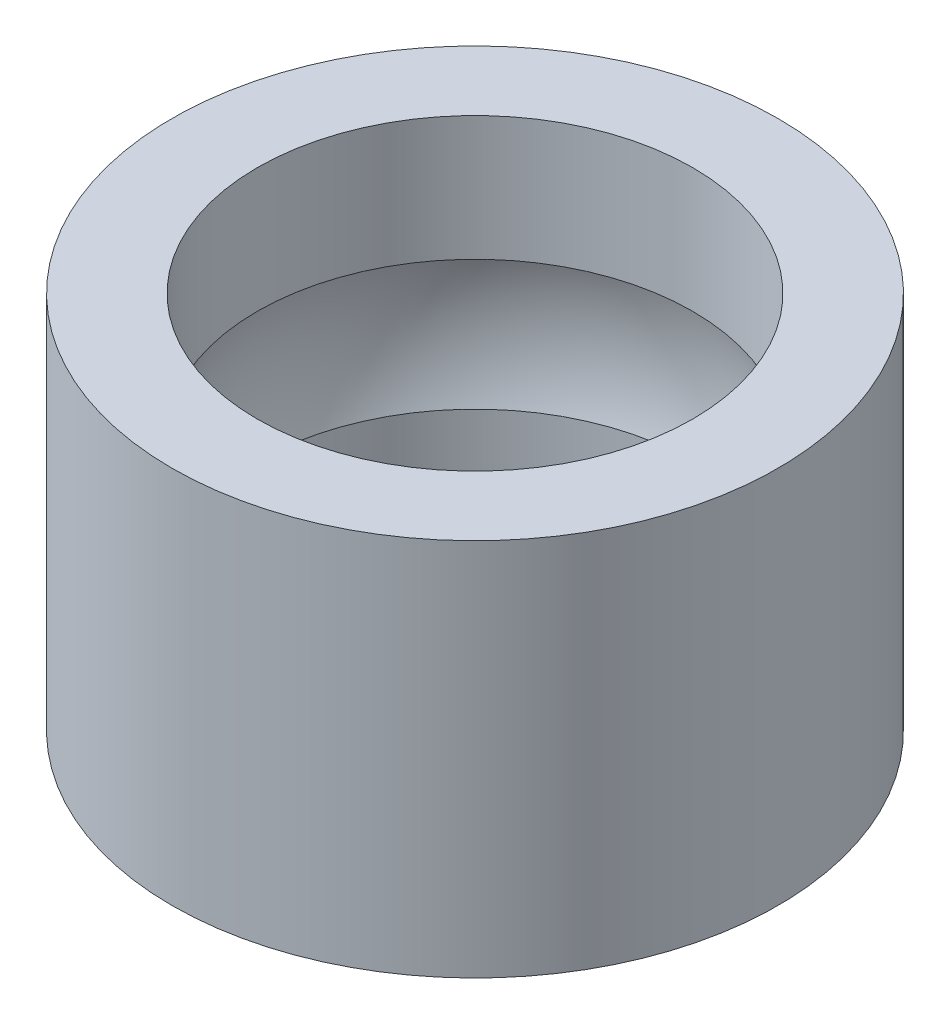
ISO-10303-21;
HEADER;
FILE_DESCRIPTION(('STEP AP214'),'2;1');
FILE_NAME('part.step','',(''),(''),'','','');
FILE_SCHEMA(('AUTOMOTIVE_DESIGN { 1 0 10303 214 1 1 1 1 }'));
ENDSEC;
DATA;
#1=APPLICATION_CONTEXT('core data for automotive mechanical design processes');
#2=APPLICATION_PROTOCOL_DEFINITION('international standard','automotive_design',2000,#1);
#3=PRODUCT_CONTEXT('',#1,'mechanical');
#4=PRODUCT('Part','Part','',(#3));
#5=PRODUCT_RELATED_PRODUCT_CATEGORY('part','',(#4));
#6=PRODUCT_DEFINITION_FORMATION('','',#4);
#7=PRODUCT_DEFINITION_CONTEXT('part definition',#1,'design');
#8=PRODUCT_DEFINITION('design','',#6,#7);
#9=PRODUCT_DEFINITION_SHAPE('','',#8);
#10=(LENGTH_UNIT() NAMED_UNIT(*) SI_UNIT(.MILLI.,.METRE.));
#11=(NAMED_UNIT(*) PLANE_ANGLE_UNIT() SI_UNIT($,.RADIAN.));
#12=(NAMED_UNIT(*) SI_UNIT($,.STERADIAN.) SOLID_ANGLE_UNIT());
#13=UNCERTAINTY_MEASURE_WITH_UNIT(LENGTH_MEASURE(1.E-05),#10,'distance_accuracy_value','');
#14=(GEOMETRIC_REPRESENTATION_CONTEXT(3) GLOBAL_UNCERTAINTY_ASSIGNED_CONTEXT((#13)) GLOBAL_UNIT_ASSIGNED_CONTEXT((#10,
#11,#12)) REPRESENTATION_CONTEXT('',''));
#15=CARTESIAN_POINT('',(0.,0.,0.));
#16=DIRECTION('',(0.,0.,1.));
#17=DIRECTION('',(1.,0.,0.));
#18=AXIS2_PLACEMENT_3D('',#15,#16,#17);
#19=CARTESIAN_POINT('',(0.,5.,0.));
#20=DIRECTION('',(0.,-1.,0.));
#21=DIRECTION('',(0.,0.,-1.));
#22=AXIS2_PLACEMENT_3D('',#19,#20,#21);
#23=CYLINDRICAL_SURFACE('',#22,4.);
#24=CARTESIAN_POINT('',(0.,5.,0.));
#25=DIRECTION('',(0.,1.,0.));
#26=DIRECTION('',(0.,0.,1.));
#27=AXIS2_PLACEMENT_3D('',#24,#25,#26);
#28=CIRCLE('',#27,4.);
#29=CARTESIAN_POINT('',(0.,5.,4.));
#30=VERTEX_POINT('',#29);
#31=EDGE_CURVE('E10',#30,#30,#28,.T.);
#32=ORIENTED_EDGE('',*,*,#31,.F.);
#33=EDGE_LOOP('',(#32));
#34=FACE_BOUND('',#33,.T.);
#35=CARTESIAN_POINT('',(0.,0.,0.));
#36=DIRECTION('',(0.,1.,0.));
#37=DIRECTION('',(0.,0.,1.));
#38=AXIS2_PLACEMENT_3D('',#35,#36,#37);
#39=CIRCLE('',#38,4.);
#40=CARTESIAN_POINT('',(0.,0.,4.));
#41=VERTEX_POINT('',#40);
#42=EDGE_CURVE('E48',#41,#41,#39,.T.);
#43=ORIENTED_EDGE('',*,*,#42,.T.);
#44=EDGE_LOOP('',(#43));
#45=FACE_BOUND('',#44,.T.);
#46=ADVANCED_FACE('F45',(#34,#45),#23,.T.);
#47=CARTESIAN_POINT('',(0.,5.,0.));
#48=DIRECTION('',(0.,1.,0.));
#49=DIRECTION('',(0.,0.,1.));
#50=AXIS2_PLACEMENT_3D('',#47,#48,#49);
#51=PLANE('',#50);
#52=CARTESIAN_POINT('',(0.,5.,0.));
#53=DIRECTION('',(0.,1.,0.));
#54=DIRECTION('',(0.,0.,1.));
#55=AXIS2_PLACEMENT_3D('',#52,#53,#54);
#56=CIRCLE('',#55,2.875);
#57=CARTESIAN_POINT('',(0.,5.,2.875));
#58=VERTEX_POINT('',#57);
#59=EDGE_CURVE('E70',#58,#58,#56,.T.);
#60=ORIENTED_EDGE('',*,*,#59,.F.);
#61=EDGE_LOOP('',(#60));
#62=FACE_BOUND('',#61,.T.);
#63=ORIENTED_EDGE('',*,*,#31,.T.);
#64=EDGE_LOOP('',(#63));
#65=FACE_BOUND('',#64,.T.);
#66=ADVANCED_FACE('F77',(#62,#65),#51,.T.);
#67=CARTESIAN_POINT('',(0.,0.,0.));
#68=DIRECTION('',(0.,1.,0.));
#69=DIRECTION('',(0.,0.,1.));
#70=AXIS2_PLACEMENT_3D('',#67,#68,#69);
#71=PLANE('',#70);
#72=CARTESIAN_POINT('',(0.,0.,0.));
#73=DIRECTION('',(0.,1.,0.));
#74=DIRECTION('',(0.,0.,1.));
#75=AXIS2_PLACEMENT_3D('',#72,#73,#74);
#76=CIRCLE('',#75,2.875);
#77=CARTESIAN_POINT('',(0.,0.,2.875));
#78=VERTEX_POINT('',#77);
#79=EDGE_CURVE('E66',#78,#78,#76,.T.);
#80=ORIENTED_EDGE('',*,*,#79,.T.);
#81=EDGE_LOOP('',(#80));
#82=FACE_BOUND('',#81,.T.);
#83=ORIENTED_EDGE('',*,*,#42,.F.);
#84=EDGE_LOOP('',(#83));
#85=FACE_BOUND('',#84,.T.);
#86=ADVANCED_FACE('F79',(#82,#85),#71,.F.);
#87=CARTESIAN_POINT('',(0.,5.765782143469,0.));
#88=DIRECTION('',(0.,1.,0.));
#89=DIRECTION('',(0.,0.,1.));
#90=AXIS2_PLACEMENT_3D('',#87,#88,#89);
#91=CYLINDRICAL_SURFACE('',#90,2.875);
#92=CARTESIAN_POINT('',(0.,3.35695682505013,0.));
#93=DIRECTION('',(0.,1.,0.));
#94=DIRECTION('',(0.,0.,1.));
#95=AXIS2_PLACEMENT_3D('',#92,#93,#94);
#96=CIRCLE('',#95,2.875);
#97=CARTESIAN_POINT('',(0.,3.35695682505013,2.875));
#98=VERTEX_POINT('',#97);
#99=EDGE_CURVE('E57',#98,#98,#96,.T.);
#100=ORIENTED_EDGE('',*,*,#99,.F.);
#101=EDGE_LOOP('',(#100));
#102=FACE_BOUND('',#101,.T.);
#103=ORIENTED_EDGE('',*,*,#59,.T.);
#104=EDGE_LOOP('',(#103));
#105=FACE_BOUND('',#104,.T.);
#106=ADVANCED_FACE('F75',(#102,#105),#91,.F.);
#107=CARTESIAN_POINT('',(0.,2.5,0.));
#108=DIRECTION('',(0.,1.,0.));
#109=DIRECTION('',(0.,0.,1.));
#110=AXIS2_PLACEMENT_3D('',#107,#108,#109);
#111=SPHERICAL_SURFACE('',#110,3.);
#112=CARTESIAN_POINT('',(0.,1.64304317494987,0.));
#113=DIRECTION('',(0.,1.,0.));
#114=DIRECTION('',(0.,0.,1.));
#115=AXIS2_PLACEMENT_3D('',#112,#113,#114);
#116=CIRCLE('',#115,2.875);
#117=CARTESIAN_POINT('',(0.,1.64304317494987,2.875));
#118=VERTEX_POINT('',#117);
#119=EDGE_CURVE('E62',#118,#118,#116,.T.);
#120=CARTESIAN_POINT('',(0.,1.64304317494987,2.875));
#121=CARTESIAN_POINT('',(0.,1.66039421367485,2.88017187788945));
#122=CARTESIAN_POINT('',(0.,1.67779208203055,2.88518664517596));
#123=CARTESIAN_POINT('',(0.,1.71267575228563,2.89490039635111));
#124=CARTESIAN_POINT('',(0.,1.730161554185,2.89959938023977));
#125=CARTESIAN_POINT('',(0.,1.76521536580959,2.90868000242728));
#126=CARTESIAN_POINT('',(0.,1.78278337553482,2.91306164072614));
#127=CARTESIAN_POINT('',(0.,1.81799584242229,2.92150614130359));
#128=CARTESIAN_POINT('',(0.,1.83564029958454,2.92556900358219));
#129=CARTESIAN_POINT('',(0.,1.87099987796741,2.93337461875086));
#130=CARTESIAN_POINT('',(0.,1.88871499918803,2.93711737164093));
#131=CARTESIAN_POINT('',(0.,1.92421009859094,2.94428154158685));
#132=CARTESIAN_POINT('',(0.,1.94199007677324,2.94770295864269));
#133=CARTESIAN_POINT('',(0.,1.97760906189142,2.95422333527406));
#134=CARTESIAN_POINT('',(0.,1.99544806882731,2.95732229484958));
#135=CARTESIAN_POINT('',(0.,2.03117926385526,2.9631967407181));
#136=CARTESIAN_POINT('',(0.,2.04907145194733,2.96597222701109));
#137=CARTESIAN_POINT('',(0.,2.08490314426824,2.97119881650787));
#138=CARTESIAN_POINT('',(0.,2.10284264849708,2.97364991971165));
#139=CARTESIAN_POINT('',(0.,2.13876309255915,2.97822693956569));
#140=CARTESIAN_POINT('',(0.,2.15674403239237,2.98035285621596));
#141=CARTESIAN_POINT('',(0.,2.19274145354907,2.98427880609138));
#142=CARTESIAN_POINT('',(0.,2.21075793487254,2.98607883931653));
#143=CARTESIAN_POINT('',(0.,2.24682053324496,2.98935243229477));
#144=CARTESIAN_POINT('',(0.,2.26486665029391,2.99082599204786));
#145=CARTESIAN_POINT('',(0.,2.30098260463806,2.99344615505214));
#146=CARTESIAN_POINT('',(0.,2.31905244193325,2.99459275830333));
#147=CARTESIAN_POINT('',(0.,2.35520991351519,2.9965586324497));
#148=CARTESIAN_POINT('',(0.,2.37329754780193,2.99737790334487));
#149=CARTESIAN_POINT('',(0.,2.40948468427843,2.99868884422391));
#150=CARTESIAN_POINT('',(0.,2.4275841864682,2.99918051420777));
#151=CARTESIAN_POINT('',(0.,2.46378912577198,2.99983609209582));
#152=CARTESIAN_POINT('',(0.,2.48189456288599,3.));
#153=CARTESIAN_POINT('',(0.,2.51810543711401,3.));
#154=CARTESIAN_POINT('',(0.,2.53621087422802,2.99983609209582));
#155=CARTESIAN_POINT('',(0.,2.5724158135318,2.99918051420778));
#156=CARTESIAN_POINT('',(0.,2.59051531572157,2.99868884422391));
#157=CARTESIAN_POINT('',(0.,2.62670245219807,2.99737790334487));
#158=CARTESIAN_POINT('',(0.,2.64479008648481,2.9965586324497));
#159=CARTESIAN_POINT('',(0.,2.68094755806674,2.99459275830333));
#160=CARTESIAN_POINT('',(0.,2.69901739536194,2.99344615505214));
#161=CARTESIAN_POINT('',(0.,2.73513334970609,2.99082599204786));
#162=CARTESIAN_POINT('',(0.,2.75317946675504,2.98935243229477));
#163=CARTESIAN_POINT('',(0.,2.78924206512746,2.98607883931653));
#164=CARTESIAN_POINT('',(0.,2.80725854645093,2.98427880609138));
#165=CARTESIAN_POINT('',(0.,2.84325596760763,2.98035285621596));
#166=CARTESIAN_POINT('',(0.,2.86123690744085,2.97822693956569));
#167=CARTESIAN_POINT('',(0.,2.89715735150292,2.97364991971165));
#168=CARTESIAN_POINT('',(0.,2.91509685573176,2.97119881650787));
#169=CARTESIAN_POINT('',(0.,2.95092854805267,2.96597222701109));
#170=CARTESIAN_POINT('',(0.,2.96882073614474,2.9631967407181));
#171=CARTESIAN_POINT('',(0.,3.00455193117269,2.95732229484958));
#172=CARTESIAN_POINT('',(0.,3.02239093810858,2.95422333527406));
#173=CARTESIAN_POINT('',(0.,3.05800992322676,2.94770295864269));
#174=CARTESIAN_POINT('',(0.,3.07578990140905,2.94428154158685));
#175=CARTESIAN_POINT('',(0.,3.11128500081197,2.93711737164093));
#176=CARTESIAN_POINT('',(0.,3.12900012203259,2.93337461875086));
#177=CARTESIAN_POINT('',(0.,3.16435970041546,2.92556900358219));
#178=CARTESIAN_POINT('',(0.,3.18200415757771,2.92150614130359));
#179=CARTESIAN_POINT('',(0.,3.21721662446518,2.91306164072614));
#180=CARTESIAN_POINT('',(0.,3.2347846341904,2.90868000242728));
#181=CARTESIAN_POINT('',(0.,3.269838445815,2.89959938023977));
#182=CARTESIAN_POINT('',(0.,3.28732424771437,2.89490039635111));
#183=CARTESIAN_POINT('',(0.,3.32220791796944,2.88518664517596));
#184=CARTESIAN_POINT('',(0.,3.33960578632515,2.88017187788946));
#185=CARTESIAN_POINT('',(0.,3.35695682505013,2.875));
#186=B_SPLINE_CURVE_WITH_KNOTS('',3,(#120,#121,#122,#123,#124,#125,#126,#127,#128,#129,#130,
#131,#132,#133,#134,#135,#136,#137,#138,#139,#140,#141,#142,#143,#144,#145,#146,#147,#148,#149,
#150,#151,#152,#153,#154,#155,#156,#157,#158,#159,#160,#161,#162,#163,#164,#165,#166,#167,#168,
#169,#170,#171,#172,#173,#174,#175,#176,#177,#178,#179,#180,#181,#182,#183,#184,#185),
.UNSPECIFIED.,.F.,.F.,(4,2,2,2,2,2,2,2,2,2,2,2,2,2,2,2,2,2,2,2,2,2,2,2,2,2,2,2,2,2,2,2,4),(0.,
0.0543155694917026,0.108631138983406,0.162946708475108,0.217262277966812,0.271577847458514,
0.325893416950217,0.38020898644192,0.434524555933623,0.488840125425326,0.543155694917029,
0.597471264408731,0.651786833900434,0.706102403392137,0.76041797288384,0.814733542375543,
0.869049111867246,0.923364681358949,0.977680250850652,1.03199582034235,1.08631138983406,
1.14062695932576,1.19494252881746,1.24925809830917,1.30357366780087,1.35788923729257,
1.41220480678427,1.46652037627598,1.52083594576768,1.57515151525938,1.62946708475109,
1.68378265424279,1.73809822373449),.UNSPECIFIED.);
#187=EDGE_CURVE('BSEAM90',#118,#98,#186,.T.);
#188=ORIENTED_EDGE('',*,*,#119,.F.);
#189=ORIENTED_EDGE('',*,*,#99,.T.);
#190=ORIENTED_EDGE('',*,*,#187,.T.);
#191=ORIENTED_EDGE('',*,*,#187,.F.);
#192=EDGE_LOOP('',(#188,#190,#189,#191));
#193=FACE_BOUND('',#192,.T.);
#194=ADVANCED_FACE('F90',(#193),#111,.F.);
#195=CARTESIAN_POINT('',(0.,5.765782143469,0.));
#196=DIRECTION('',(0.,1.,0.));
#197=DIRECTION('',(0.,0.,1.));
#198=AXIS2_PLACEMENT_3D('',#195,#196,#197);
#199=CYLINDRICAL_SURFACE('',#198,2.875);
#200=ORIENTED_EDGE('',*,*,#119,.T.);
#201=EDGE_LOOP('',(#200));
#202=FACE_BOUND('',#201,.T.);
#203=ORIENTED_EDGE('',*,*,#79,.F.);
#204=EDGE_LOOP('',(#203));
#205=FACE_BOUND('',#204,.T.);
#206=ADVANCED_FACE('F94',(#202,#205),#199,.F.);
#207=CLOSED_SHELL('',(#46,#66,#86,#106,#194,#206));
#208=MANIFOLD_SOLID_BREP('B2',#207);
#209=ADVANCED_BREP_SHAPE_REPRESENTATION('',(#18,#208),#14);
#210=SHAPE_DEFINITION_REPRESENTATION(#9,#209);
ENDSEC;
END-ISO-10303-21;
